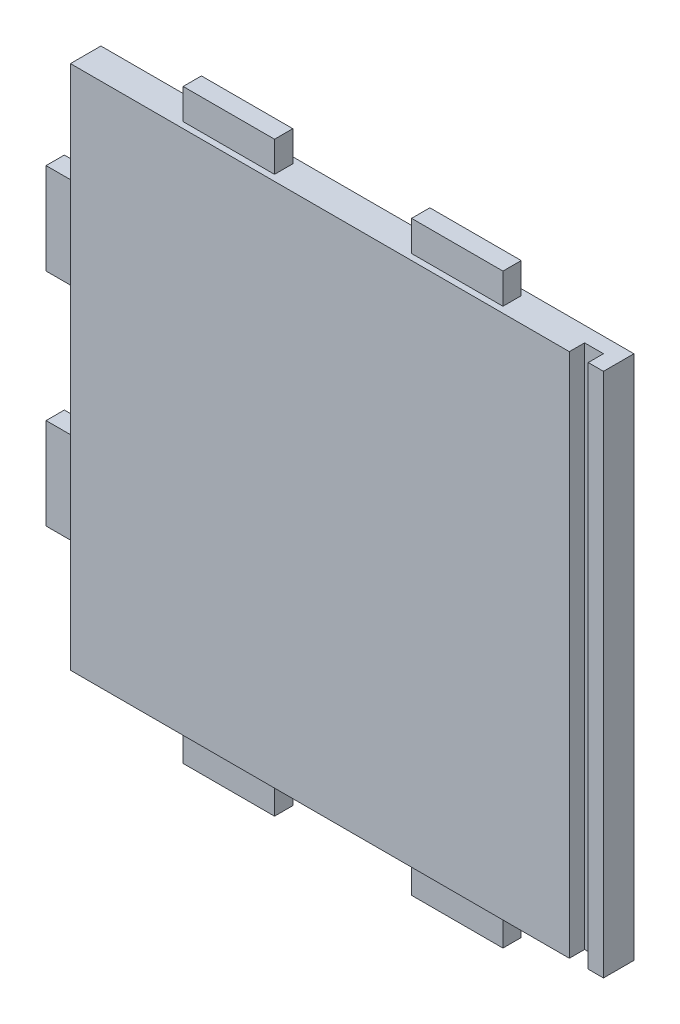
ISO-10303-21;
HEADER;
FILE_DESCRIPTION(('STEP AP214'),'2;1');
FILE_NAME('part.step','',(''),(''),'','','');
FILE_SCHEMA(('AUTOMOTIVE_DESIGN { 1 0 10303 214 1 1 1 1 }'));
ENDSEC;
DATA;
#1=APPLICATION_CONTEXT('core data for automotive mechanical design processes');
#2=APPLICATION_PROTOCOL_DEFINITION('international standard','automotive_design',2000,#1);
#3=PRODUCT_CONTEXT('',#1,'mechanical');
#4=PRODUCT('Part','Part','',(#3));
#5=PRODUCT_RELATED_PRODUCT_CATEGORY('part','',(#4));
#6=PRODUCT_DEFINITION_FORMATION('','',#4);
#7=PRODUCT_DEFINITION_CONTEXT('part definition',#1,'design');
#8=PRODUCT_DEFINITION('design','',#6,#7);
#9=PRODUCT_DEFINITION_SHAPE('','',#8);
#10=(LENGTH_UNIT() NAMED_UNIT(*) SI_UNIT(.MILLI.,.METRE.));
#11=(NAMED_UNIT(*) PLANE_ANGLE_UNIT() SI_UNIT($,.RADIAN.));
#12=(NAMED_UNIT(*) SI_UNIT($,.STERADIAN.) SOLID_ANGLE_UNIT());
#13=UNCERTAINTY_MEASURE_WITH_UNIT(LENGTH_MEASURE(1.E-05),#10,'distance_accuracy_value','');
#14=(GEOMETRIC_REPRESENTATION_CONTEXT(3) GLOBAL_UNCERTAINTY_ASSIGNED_CONTEXT((#13)) GLOBAL_UNIT_ASSIGNED_CONTEXT((#10,
#11,#12)) REPRESENTATION_CONTEXT('',''));
#15=CARTESIAN_POINT('',(0.,0.,0.));
#16=DIRECTION('',(0.,0.,1.));
#17=DIRECTION('',(1.,0.,0.));
#18=AXIS2_PLACEMENT_3D('',#15,#16,#17);
#19=CARTESIAN_POINT('',(0.,0.,10.));
#20=DIRECTION('',(0.,0.,1.));
#21=DIRECTION('',(1.,0.,0.));
#22=AXIS2_PLACEMENT_3D('',#19,#20,#21);
#23=PLANE('',#22);
#24=DIRECTION('',(0.,-1.,0.));
#25=VECTOR('',#24,1.);
#26=CARTESIAN_POINT('',(76.3,-86.25,10.));
#27=LINE('',#26,#25);
#28=CARTESIAN_POINT('',(76.3,86.25,10.));
#29=VERTEX_POINT('',#28);
#30=CARTESIAN_POINT('',(76.3,-86.25,10.));
#31=VERTEX_POINT('',#30);
#32=EDGE_CURVE('E246',#29,#31,#27,.T.);
#33=ORIENTED_EDGE('',*,*,#32,.F.);
#34=DIRECTION('',(-1.,0.,0.));
#35=VECTOR('',#34,1.);
#36=CARTESIAN_POINT('',(87.5,86.25,10.));
#37=LINE('',#36,#35);
#38=CARTESIAN_POINT('',(-87.5,86.25,10.));
#39=VERTEX_POINT('',#38);
#40=EDGE_CURVE('E483',#29,#39,#37,.T.);
#41=ORIENTED_EDGE('',*,*,#40,.T.);
#42=DIRECTION('',(0.,-1.,0.));
#43=VECTOR('',#42,1.);
#44=CARTESIAN_POINT('',(-87.5,-86.25,10.));
#45=LINE('',#44,#43);
#46=CARTESIAN_POINT('',(-87.5,-86.25,10.));
#47=VERTEX_POINT('',#46);
#48=EDGE_CURVE('E474',#39,#47,#45,.T.);
#49=ORIENTED_EDGE('',*,*,#48,.T.);
#50=DIRECTION('',(1.,0.,0.));
#51=VECTOR('',#50,1.);
#52=CARTESIAN_POINT('',(87.5,-86.25,10.));
#53=LINE('',#52,#51);
#54=EDGE_CURVE('E479',#47,#31,#53,.T.);
#55=ORIENTED_EDGE('',*,*,#54,.T.);
#56=EDGE_LOOP('',(#33,#41,#49,#55));
#57=FACE_BOUND('',#56,.T.);
#58=ADVANCED_FACE('F32',(#57),#23,.T.);
#59=CARTESIAN_POINT('',(87.5,-86.25,10.));
#60=DIRECTION('',(0.,1.,0.));
#61=DIRECTION('',(-1.,0.,0.));
#62=AXIS2_PLACEMENT_3D('',#59,#60,#61);
#63=PLANE('',#62);
#64=CARTESIAN_POINT('',(65.,-86.25,5.));
#65=DIRECTION('',(0.,-1.,0.));
#66=DIRECTION('',(1.,0.,0.));
#67=AXIS2_PLACEMENT_3D('',#64,#65,#66);
#68=CIRCLE('',#67,1.5);
#69=CARTESIAN_POINT('',(66.5,-86.25,5.));
#70=VERTEX_POINT('',#69);
#71=EDGE_CURVE('E946',#70,#70,#68,.T.);
#72=ORIENTED_EDGE('',*,*,#71,.F.);
#73=EDGE_LOOP('',(#72));
#74=FACE_BOUND('',#73,.T.);
#75=DIRECTION('',(0.,0.,-1.));
#76=VECTOR('',#75,1.);
#77=CARTESIAN_POINT('',(-52.5,-86.25,2.));
#78=LINE('',#77,#76);
#79=CARTESIAN_POINT('',(-52.5,-86.25,8.));
#80=VERTEX_POINT('',#79);
#81=CARTESIAN_POINT('',(-52.5,-86.25,2.));
#82=VERTEX_POINT('',#81);
#83=EDGE_CURVE('E308',#80,#82,#78,.T.);
#84=ORIENTED_EDGE('',*,*,#83,.F.);
#85=DIRECTION('',(-1.,0.,0.));
#86=VECTOR('',#85,1.);
#87=CARTESIAN_POINT('',(-22.5,-86.25,8.));
#88=LINE('',#87,#86);
#89=CARTESIAN_POINT('',(-22.5,-86.25,8.));
#90=VERTEX_POINT('',#89);
#91=EDGE_CURVE('E313',#90,#80,#88,.T.);
#92=ORIENTED_EDGE('',*,*,#91,.F.);
#93=DIRECTION('',(0.,0.,1.));
#94=VECTOR('',#93,1.);
#95=CARTESIAN_POINT('',(-22.5,-86.25,2.));
#96=LINE('',#95,#94);
#97=CARTESIAN_POINT('',(-22.5,-86.25,2.));
#98=VERTEX_POINT('',#97);
#99=EDGE_CURVE('E325',#98,#90,#96,.T.);
#100=ORIENTED_EDGE('',*,*,#99,.F.);
#101=DIRECTION('',(1.,0.,0.));
#102=VECTOR('',#101,1.);
#103=CARTESIAN_POINT('',(-22.5,-86.25,2.));
#104=LINE('',#103,#102);
#105=EDGE_CURVE('E322',#82,#98,#104,.T.);
#106=ORIENTED_EDGE('',*,*,#105,.F.);
#107=EDGE_LOOP('',(#84,#92,#100,#106));
#108=FACE_BOUND('',#107,.T.);
#109=DIRECTION('',(1.,0.,0.));
#110=VECTOR('',#109,1.);
#111=CARTESIAN_POINT('',(82.5,-86.25,5.));
#112=LINE('',#111,#110);
#113=CARTESIAN_POINT('',(76.3,-86.25,5.));
#114=VERTEX_POINT('',#113);
#115=CARTESIAN_POINT('',(82.5,-86.25,5.));
#116=VERTEX_POINT('',#115);
#117=EDGE_CURVE('E256',#114,#116,#112,.T.);
#118=ORIENTED_EDGE('',*,*,#117,.F.);
#119=DIRECTION('',(0.,0.,1.));
#120=VECTOR('',#119,1.);
#121=CARTESIAN_POINT('',(76.3,-86.25,5.));
#122=LINE('',#121,#120);
#123=EDGE_CURVE('E240',#114,#31,#122,.T.);
#124=ORIENTED_EDGE('',*,*,#123,.T.);
#125=ORIENTED_EDGE('',*,*,#54,.F.);
#126=DIRECTION('',(0.,0.,-1.));
#127=VECTOR('',#126,1.);
#128=CARTESIAN_POINT('',(-87.5,-86.25,10.));
#129=LINE('',#128,#127);
#130=CARTESIAN_POINT('',(-87.5,-86.25,0.));
#131=VERTEX_POINT('',#130);
#132=EDGE_CURVE('E11',#47,#131,#129,.T.);
#133=ORIENTED_EDGE('',*,*,#132,.T.);
#134=DIRECTION('',(1.,0.,0.));
#135=VECTOR('',#134,1.);
#136=CARTESIAN_POINT('',(87.5,-86.25,0.));
#137=LINE('',#136,#135);
#138=CARTESIAN_POINT('',(87.5,-86.25,0.));
#139=VERTEX_POINT('',#138);
#140=EDGE_CURVE('E490',#131,#139,#137,.T.);
#141=ORIENTED_EDGE('',*,*,#140,.T.);
#142=DIRECTION('',(0.,0.,-1.));
#143=VECTOR('',#142,1.);
#144=CARTESIAN_POINT('',(87.5,-86.25,10.));
#145=LINE('',#144,#143);
#146=CARTESIAN_POINT('',(87.5,-86.25,10.));
#147=VERTEX_POINT('',#146);
#148=EDGE_CURVE('E40',#147,#139,#145,.T.);
#149=ORIENTED_EDGE('',*,*,#148,.F.);
#150=CARTESIAN_POINT('',(82.5,-86.25,10.));
#151=VERTEX_POINT('',#150);
#152=EDGE_CURVE('E477',#151,#147,#53,.T.);
#153=ORIENTED_EDGE('',*,*,#152,.F.);
#154=DIRECTION('',(0.,0.,1.));
#155=VECTOR('',#154,1.);
#156=CARTESIAN_POINT('',(82.5,-86.25,5.));
#157=LINE('',#156,#155);
#158=EDGE_CURVE('E47',#116,#151,#157,.T.);
#159=ORIENTED_EDGE('',*,*,#158,.F.);
#160=EDGE_LOOP('',(#118,#124,#125,#133,#141,#149,#153,#159));
#161=FACE_BOUND('',#160,.T.);
#162=DIRECTION('',(0.,0.,-1.));
#163=VECTOR('',#162,1.);
#164=CARTESIAN_POINT('',(22.5,-86.25,2.));
#165=LINE('',#164,#163);
#166=CARTESIAN_POINT('',(22.5,-86.25,8.));
#167=VERTEX_POINT('',#166);
#168=CARTESIAN_POINT('',(22.5,-86.25,2.));
#169=VERTEX_POINT('',#168);
#170=EDGE_CURVE('E274',#167,#169,#165,.T.);
#171=ORIENTED_EDGE('',*,*,#170,.F.);
#172=DIRECTION('',(-1.,0.,0.));
#173=VECTOR('',#172,1.);
#174=CARTESIAN_POINT('',(22.5,-86.25,8.));
#175=LINE('',#174,#173);
#176=CARTESIAN_POINT('',(52.5,-86.25,8.));
#177=VERTEX_POINT('',#176);
#178=EDGE_CURVE('E283',#177,#167,#175,.T.);
#179=ORIENTED_EDGE('',*,*,#178,.F.);
#180=DIRECTION('',(0.,0.,1.));
#181=VECTOR('',#180,1.);
#182=CARTESIAN_POINT('',(52.5,-86.25,2.));
#183=LINE('',#182,#181);
#184=CARTESIAN_POINT('',(52.5,-86.25,2.));
#185=VERTEX_POINT('',#184);
#186=EDGE_CURVE('E293',#185,#177,#183,.T.);
#187=ORIENTED_EDGE('',*,*,#186,.F.);
#188=DIRECTION('',(1.,0.,0.));
#189=VECTOR('',#188,1.);
#190=CARTESIAN_POINT('',(22.5,-86.25,2.));
#191=LINE('',#190,#189);
#192=EDGE_CURVE('E55',#169,#185,#191,.T.);
#193=ORIENTED_EDGE('',*,*,#192,.F.);
#194=EDGE_LOOP('',(#171,#179,#187,#193));
#195=FACE_BOUND('',#194,.T.);
#196=ADVANCED_FACE('F261',(#74,#108,#161,#195),#63,.F.);
#197=CARTESIAN_POINT('',(-87.5,-86.25,10.));
#198=DIRECTION('',(1.,0.,0.));
#199=DIRECTION('',(0.,0.,-1.));
#200=AXIS2_PLACEMENT_3D('',#197,#198,#199);
#201=PLANE('',#200);
#202=CARTESIAN_POINT('',(-87.5,-71.25,5.00000000000002));
#203=DIRECTION('',(-1.,0.,0.));
#204=DIRECTION('',(0.,0.,1.));
#205=AXIS2_PLACEMENT_3D('',#202,#203,#204);
#206=CIRCLE('',#205,1.5);
#207=CARTESIAN_POINT('',(-87.5,-71.25,6.50000000000002));
#208=VERTEX_POINT('',#207);
#209=EDGE_CURVE('E562',#208,#208,#206,.T.);
#210=ORIENTED_EDGE('',*,*,#209,.F.);
#211=EDGE_LOOP('',(#210));
#212=FACE_BOUND('',#211,.T.);
#213=DIRECTION('',(0.,-1.,0.));
#214=VECTOR('',#213,1.);
#215=CARTESIAN_POINT('',(-87.5,21.25,2.00000000000001));
#216=LINE('',#215,#214);
#217=CARTESIAN_POINT('',(-87.5,51.25,2.00000000000001));
#218=VERTEX_POINT('',#217);
#219=CARTESIAN_POINT('',(-87.5,21.25,2.00000000000001));
#220=VERTEX_POINT('',#219);
#221=EDGE_CURVE('E374',#218,#220,#216,.T.);
#222=ORIENTED_EDGE('',*,*,#221,.F.);
#223=DIRECTION('',(0.,0.,-1.));
#224=VECTOR('',#223,1.);
#225=CARTESIAN_POINT('',(-87.5,51.25,8.00000000000001));
#226=LINE('',#225,#224);
#227=CARTESIAN_POINT('',(-87.5,51.25,8.00000000000001));
#228=VERTEX_POINT('',#227);
#229=EDGE_CURVE('E379',#228,#218,#226,.T.);
#230=ORIENTED_EDGE('',*,*,#229,.F.);
#231=DIRECTION('',(0.,1.,0.));
#232=VECTOR('',#231,1.);
#233=CARTESIAN_POINT('',(-87.5,21.25,8.00000000000001));
#234=LINE('',#233,#232);
#235=CARTESIAN_POINT('',(-87.5,21.25,8.00000000000001));
#236=VERTEX_POINT('',#235);
#237=EDGE_CURVE('E391',#236,#228,#234,.T.);
#238=ORIENTED_EDGE('',*,*,#237,.F.);
#239=DIRECTION('',(0.,0.,1.));
#240=VECTOR('',#239,1.);
#241=CARTESIAN_POINT('',(-87.5,21.25,8.00000000000001));
#242=LINE('',#241,#240);
#243=EDGE_CURVE('E388',#220,#236,#242,.T.);
#244=ORIENTED_EDGE('',*,*,#243,.F.);
#245=EDGE_LOOP('',(#222,#230,#238,#244));
#246=FACE_BOUND('',#245,.T.);
#247=DIRECTION('',(0.,-1.,0.));
#248=VECTOR('',#247,1.);
#249=CARTESIAN_POINT('',(-87.5,-86.25,0.));
#250=LINE('',#249,#248);
#251=CARTESIAN_POINT('',(-87.5,86.25,0.));
#252=VERTEX_POINT('',#251);
#253=EDGE_CURVE('E473',#252,#131,#250,.T.);
#254=ORIENTED_EDGE('',*,*,#253,.T.);
#255=ORIENTED_EDGE('',*,*,#132,.F.);
#256=ORIENTED_EDGE('',*,*,#48,.F.);
#257=DIRECTION('',(0.,0.,-1.));
#258=VECTOR('',#257,1.);
#259=CARTESIAN_POINT('',(-87.5,86.25,10.));
#260=LINE('',#259,#258);
#261=EDGE_CURVE('E487',#39,#252,#260,.T.);
#262=ORIENTED_EDGE('',*,*,#261,.T.);
#263=EDGE_LOOP('',(#254,#255,#256,#262));
#264=FACE_BOUND('',#263,.T.);
#265=DIRECTION('',(0.,1.,0.));
#266=VECTOR('',#265,1.);
#267=CARTESIAN_POINT('',(-87.5,-21.25,8.00000000000001));
#268=LINE('',#267,#266);
#269=CARTESIAN_POINT('',(-87.5,-51.25,8.00000000000001));
#270=VERTEX_POINT('',#269);
#271=CARTESIAN_POINT('',(-87.5,-21.25,8.00000000000001));
#272=VERTEX_POINT('',#271);
#273=EDGE_CURVE('E341',#270,#272,#268,.T.);
#274=ORIENTED_EDGE('',*,*,#273,.F.);
#275=DIRECTION('',(0.,0.,1.));
#276=VECTOR('',#275,1.);
#277=CARTESIAN_POINT('',(-87.5,-51.25,8.00000000000001));
#278=LINE('',#277,#276);
#279=CARTESIAN_POINT('',(-87.5,-51.25,2.00000000000001));
#280=VERTEX_POINT('',#279);
#281=EDGE_CURVE('E346',#280,#270,#278,.T.);
#282=ORIENTED_EDGE('',*,*,#281,.F.);
#283=DIRECTION('',(0.,-1.,0.));
#284=VECTOR('',#283,1.);
#285=CARTESIAN_POINT('',(-87.5,-21.25,2.00000000000001));
#286=LINE('',#285,#284);
#287=CARTESIAN_POINT('',(-87.5,-21.25,2.00000000000001));
#288=VERTEX_POINT('',#287);
#289=EDGE_CURVE('E358',#288,#280,#286,.T.);
#290=ORIENTED_EDGE('',*,*,#289,.F.);
#291=DIRECTION('',(0.,0.,-1.));
#292=VECTOR('',#291,1.);
#293=CARTESIAN_POINT('',(-87.5,-21.25,8.00000000000001));
#294=LINE('',#293,#292);
#295=EDGE_CURVE('E355',#272,#288,#294,.T.);
#296=ORIENTED_EDGE('',*,*,#295,.F.);
#297=EDGE_LOOP('',(#274,#282,#290,#296));
#298=FACE_BOUND('',#297,.T.);
#299=ADVANCED_FACE('F34',(#212,#246,#264,#298),#201,.F.);
#300=CARTESIAN_POINT('',(87.5,86.25,10.));
#301=DIRECTION('',(0.,-1.,0.));
#302=DIRECTION('',(1.,0.,0.));
#303=AXIS2_PLACEMENT_3D('',#300,#301,#302);
#304=PLANE('',#303);
#305=ORIENTED_EDGE('',*,*,#40,.F.);
#306=DIRECTION('',(0.,0.,1.));
#307=VECTOR('',#306,1.);
#308=CARTESIAN_POINT('',(76.3,86.25,5.));
#309=LINE('',#308,#307);
#310=CARTESIAN_POINT('',(76.3,86.25,5.));
#311=VERTEX_POINT('',#310);
#312=EDGE_CURVE('E272',#311,#29,#309,.T.);
#313=ORIENTED_EDGE('',*,*,#312,.F.);
#314=DIRECTION('',(-1.,0.,0.));
#315=VECTOR('',#314,1.);
#316=CARTESIAN_POINT('',(82.5,86.25,5.));
#317=LINE('',#316,#315);
#318=CARTESIAN_POINT('',(82.5,86.25,5.));
#319=VERTEX_POINT('',#318);
#320=EDGE_CURVE('E250',#319,#311,#317,.T.);
#321=ORIENTED_EDGE('',*,*,#320,.F.);
#322=DIRECTION('',(0.,0.,1.));
#323=VECTOR('',#322,1.);
#324=CARTESIAN_POINT('',(82.5,86.25,5.));
#325=LINE('',#324,#323);
#326=CARTESIAN_POINT('',(82.5,86.25,10.));
#327=VERTEX_POINT('',#326);
#328=EDGE_CURVE('E275',#319,#327,#325,.T.);
#329=ORIENTED_EDGE('',*,*,#328,.T.);
#330=CARTESIAN_POINT('',(87.5,86.25,10.));
#331=VERTEX_POINT('',#330);
#332=EDGE_CURVE('E484',#331,#327,#37,.T.);
#333=ORIENTED_EDGE('',*,*,#332,.F.);
#334=DIRECTION('',(0.,0.,-1.));
#335=VECTOR('',#334,1.);
#336=CARTESIAN_POINT('',(87.5,86.25,10.));
#337=LINE('',#336,#335);
#338=CARTESIAN_POINT('',(87.5,86.25,0.));
#339=VERTEX_POINT('',#338);
#340=EDGE_CURVE('E497',#331,#339,#337,.T.);
#341=ORIENTED_EDGE('',*,*,#340,.T.);
#342=DIRECTION('',(-1.,0.,0.));
#343=VECTOR('',#342,1.);
#344=CARTESIAN_POINT('',(87.5,86.25,0.));
#345=LINE('',#344,#343);
#346=EDGE_CURVE('E478',#339,#252,#345,.T.);
#347=ORIENTED_EDGE('',*,*,#346,.T.);
#348=ORIENTED_EDGE('',*,*,#261,.F.);
#349=EDGE_LOOP('',(#305,#313,#321,#329,#333,#341,#347,#348));
#350=FACE_BOUND('',#349,.T.);
#351=DIRECTION('',(0.,0.,1.));
#352=VECTOR('',#351,1.);
#353=CARTESIAN_POINT('',(-52.5,86.25,7.99999999999998));
#354=LINE('',#353,#352);
#355=CARTESIAN_POINT('',(-52.5,86.25,1.99999999999999));
#356=VERTEX_POINT('',#355);
#357=CARTESIAN_POINT('',(-52.5,86.25,7.99999999999998));
#358=VERTEX_POINT('',#357);
#359=EDGE_CURVE('E440',#356,#358,#354,.T.);
#360=ORIENTED_EDGE('',*,*,#359,.F.);
#361=DIRECTION('',(-1.,0.,0.));
#362=VECTOR('',#361,1.);
#363=CARTESIAN_POINT('',(-22.5,86.25,1.99999999999998));
#364=LINE('',#363,#362);
#365=CARTESIAN_POINT('',(-22.5,86.25,1.99999999999998));
#366=VERTEX_POINT('',#365);
#367=EDGE_CURVE('E445',#366,#356,#364,.T.);
#368=ORIENTED_EDGE('',*,*,#367,.F.);
#369=DIRECTION('',(0.,0.,-1.));
#370=VECTOR('',#369,1.);
#371=CARTESIAN_POINT('',(-22.5,86.25,7.99999999999998));
#372=LINE('',#371,#370);
#373=CARTESIAN_POINT('',(-22.5,86.25,7.99999999999998));
#374=VERTEX_POINT('',#373);
#375=EDGE_CURVE('E457',#374,#366,#372,.T.);
#376=ORIENTED_EDGE('',*,*,#375,.F.);
#377=DIRECTION('',(1.,0.,0.));
#378=VECTOR('',#377,1.);
#379=CARTESIAN_POINT('',(-22.5,86.25,7.99999999999998));
#380=LINE('',#379,#378);
#381=EDGE_CURVE('E454',#358,#374,#380,.T.);
#382=ORIENTED_EDGE('',*,*,#381,.F.);
#383=EDGE_LOOP('',(#360,#368,#376,#382));
#384=FACE_BOUND('',#383,.T.);
#385=DIRECTION('',(0.,0.,1.));
#386=VECTOR('',#385,1.);
#387=CARTESIAN_POINT('',(22.5,86.25,7.99999999999998));
#388=LINE('',#387,#386);
#389=CARTESIAN_POINT('',(22.5,86.25,1.99999999999998));
#390=VERTEX_POINT('',#389);
#391=CARTESIAN_POINT('',(22.5,86.25,7.99999999999998));
#392=VERTEX_POINT('',#391);
#393=EDGE_CURVE('E407',#390,#392,#388,.T.);
#394=ORIENTED_EDGE('',*,*,#393,.F.);
#395=DIRECTION('',(-1.,0.,0.));
#396=VECTOR('',#395,1.);
#397=CARTESIAN_POINT('',(22.5,86.25,1.99999999999998));
#398=LINE('',#397,#396);
#399=CARTESIAN_POINT('',(52.5,86.25,1.99999999999997));
#400=VERTEX_POINT('',#399);
#401=EDGE_CURVE('E412',#400,#390,#398,.T.);
#402=ORIENTED_EDGE('',*,*,#401,.F.);
#403=DIRECTION('',(0.,0.,-1.));
#404=VECTOR('',#403,1.);
#405=CARTESIAN_POINT('',(52.5,86.25,7.99999999999997));
#406=LINE('',#405,#404);
#407=CARTESIAN_POINT('',(52.5,86.25,7.99999999999997));
#408=VERTEX_POINT('',#407);
#409=EDGE_CURVE('E424',#408,#400,#406,.T.);
#410=ORIENTED_EDGE('',*,*,#409,.F.);
#411=DIRECTION('',(1.,0.,0.));
#412=VECTOR('',#411,1.);
#413=CARTESIAN_POINT('',(22.5,86.25,7.99999999999998));
#414=LINE('',#413,#412);
#415=EDGE_CURVE('E421',#392,#408,#414,.T.);
#416=ORIENTED_EDGE('',*,*,#415,.F.);
#417=EDGE_LOOP('',(#394,#402,#410,#416));
#418=FACE_BOUND('',#417,.T.);
#419=ADVANCED_FACE('F513',(#350,#384,#418),#304,.F.);
#420=CARTESIAN_POINT('',(87.5,-86.25,10.));
#421=DIRECTION('',(-1.,0.,0.));
#422=DIRECTION('',(0.,0.,1.));
#423=AXIS2_PLACEMENT_3D('',#420,#421,#422);
#424=PLANE('',#423);
#425=DIRECTION('',(0.,1.,0.));
#426=VECTOR('',#425,1.);
#427=CARTESIAN_POINT('',(87.5,-86.25,0.));
#428=LINE('',#427,#426);
#429=EDGE_CURVE('E492',#139,#339,#428,.T.);
#430=ORIENTED_EDGE('',*,*,#429,.T.);
#431=ORIENTED_EDGE('',*,*,#340,.F.);
#432=DIRECTION('',(0.,1.,0.));
#433=VECTOR('',#432,1.);
#434=CARTESIAN_POINT('',(87.5,-86.25,10.));
#435=LINE('',#434,#433);
#436=EDGE_CURVE('E481',#147,#331,#435,.T.);
#437=ORIENTED_EDGE('',*,*,#436,.F.);
#438=ORIENTED_EDGE('',*,*,#148,.T.);
#439=EDGE_LOOP('',(#430,#431,#437,#438));
#440=FACE_BOUND('',#439,.T.);
#441=ADVANCED_FACE('F504',(#440),#424,.F.);
#442=DIRECTION('',(0.,1.,0.));
#443=VECTOR('',#442,1.);
#444=CARTESIAN_POINT('',(82.5,-86.25,10.));
#445=LINE('',#444,#443);
#446=EDGE_CURVE('E259',#151,#327,#445,.T.);
#447=ORIENTED_EDGE('',*,*,#446,.F.);
#448=ORIENTED_EDGE('',*,*,#152,.T.);
#449=ORIENTED_EDGE('',*,*,#436,.T.);
#450=ORIENTED_EDGE('',*,*,#332,.T.);
#451=EDGE_LOOP('',(#447,#448,#449,#450));
#452=FACE_BOUND('',#451,.T.);
#453=ADVANCED_FACE('F522',(#452),#23,.T.);
#454=CARTESIAN_POINT('',(0.,0.,0.));
#455=DIRECTION('',(0.,0.,1.));
#456=DIRECTION('',(1.,0.,0.));
#457=AXIS2_PLACEMENT_3D('',#454,#455,#456);
#458=PLANE('',#457);
#459=ORIENTED_EDGE('',*,*,#253,.F.);
#460=ORIENTED_EDGE('',*,*,#346,.F.);
#461=ORIENTED_EDGE('',*,*,#429,.F.);
#462=ORIENTED_EDGE('',*,*,#140,.F.);
#463=EDGE_LOOP('',(#459,#460,#461,#462));
#464=FACE_BOUND('',#463,.T.);
#465=ADVANCED_FACE('F509',(#464),#458,.F.);
#466=CARTESIAN_POINT('',(-52.5,96.25,7.99999999999998));
#467=DIRECTION('',(1.,0.,0.));
#468=DIRECTION('',(0.,1.,0.));
#469=AXIS2_PLACEMENT_3D('',#466,#467,#468);
#470=PLANE('',#469);
#471=ORIENTED_EDGE('',*,*,#359,.T.);
#472=DIRECTION('',(0.,-1.,0.));
#473=VECTOR('',#472,1.);
#474=CARTESIAN_POINT('',(-52.5,96.25,7.99999999999998));
#475=LINE('',#474,#473);
#476=CARTESIAN_POINT('',(-52.5,96.25,7.99999999999998));
#477=VERTEX_POINT('',#476);
#478=EDGE_CURVE('E470',#477,#358,#475,.T.);
#479=ORIENTED_EDGE('',*,*,#478,.F.);
#480=DIRECTION('',(0.,0.,1.));
#481=VECTOR('',#480,1.);
#482=CARTESIAN_POINT('',(-52.5,96.25,7.99999999999998));
#483=LINE('',#482,#481);
#484=CARTESIAN_POINT('',(-52.5,96.25,1.99999999999999));
#485=VERTEX_POINT('',#484);
#486=EDGE_CURVE('E441',#485,#477,#483,.T.);
#487=ORIENTED_EDGE('',*,*,#486,.F.);
#488=DIRECTION('',(0.,-1.,0.));
#489=VECTOR('',#488,1.);
#490=CARTESIAN_POINT('',(-52.5,96.25,1.99999999999999));
#491=LINE('',#490,#489);
#492=EDGE_CURVE('E451',#485,#356,#491,.T.);
#493=ORIENTED_EDGE('',*,*,#492,.T.);
#494=EDGE_LOOP('',(#471,#479,#487,#493));
#495=FACE_BOUND('',#494,.T.);
#496=ADVANCED_FACE('F547',(#495),#470,.F.);
#497=CARTESIAN_POINT('',(-22.5,96.25,7.99999999999998));
#498=DIRECTION('',(0.,0.,-1.));
#499=DIRECTION('',(-1.,0.,0.));
#500=AXIS2_PLACEMENT_3D('',#497,#498,#499);
#501=PLANE('',#500);
#502=ORIENTED_EDGE('',*,*,#381,.T.);
#503=DIRECTION('',(0.,-1.,0.));
#504=VECTOR('',#503,1.);
#505=CARTESIAN_POINT('',(-22.5,96.25,7.99999999999998));
#506=LINE('',#505,#504);
#507=CARTESIAN_POINT('',(-22.5,96.25,7.99999999999998));
#508=VERTEX_POINT('',#507);
#509=EDGE_CURVE('E467',#508,#374,#506,.T.);
#510=ORIENTED_EDGE('',*,*,#509,.F.);
#511=DIRECTION('',(1.,0.,0.));
#512=VECTOR('',#511,1.);
#513=CARTESIAN_POINT('',(-22.5,96.25,7.99999999999998));
#514=LINE('',#513,#512);
#515=EDGE_CURVE('E444',#477,#508,#514,.T.);
#516=ORIENTED_EDGE('',*,*,#515,.F.);
#517=ORIENTED_EDGE('',*,*,#478,.T.);
#518=EDGE_LOOP('',(#502,#510,#516,#517));
#519=FACE_BOUND('',#518,.T.);
#520=ADVANCED_FACE('F621',(#519),#501,.F.);
#521=CARTESIAN_POINT('',(-22.5,96.25,7.99999999999998));
#522=DIRECTION('',(-1.,0.,0.));
#523=DIRECTION('',(0.,-1.,0.));
#524=AXIS2_PLACEMENT_3D('',#521,#522,#523);
#525=PLANE('',#524);
#526=ORIENTED_EDGE('',*,*,#375,.T.);
#527=DIRECTION('',(0.,-1.,0.));
#528=VECTOR('',#527,1.);
#529=CARTESIAN_POINT('',(-22.5,96.25,1.99999999999998));
#530=LINE('',#529,#528);
#531=CARTESIAN_POINT('',(-22.5,96.25,1.99999999999998));
#532=VERTEX_POINT('',#531);
#533=EDGE_CURVE('E464',#532,#366,#530,.T.);
#534=ORIENTED_EDGE('',*,*,#533,.F.);
#535=DIRECTION('',(0.,0.,-1.));
#536=VECTOR('',#535,1.);
#537=CARTESIAN_POINT('',(-22.5,96.25,7.99999999999998));
#538=LINE('',#537,#536);
#539=EDGE_CURVE('E447',#508,#532,#538,.T.);
#540=ORIENTED_EDGE('',*,*,#539,.F.);
#541=ORIENTED_EDGE('',*,*,#509,.T.);
#542=EDGE_LOOP('',(#526,#534,#540,#541));
#543=FACE_BOUND('',#542,.T.);
#544=ADVANCED_FACE('F617',(#543),#525,.F.);
#545=CARTESIAN_POINT('',(-22.5,96.25,1.99999999999998));
#546=DIRECTION('',(0.,0.,1.));
#547=DIRECTION('',(1.,0.,0.));
#548=AXIS2_PLACEMENT_3D('',#545,#546,#547);
#549=PLANE('',#548);
#550=ORIENTED_EDGE('',*,*,#367,.T.);
#551=ORIENTED_EDGE('',*,*,#492,.F.);
#552=DIRECTION('',(-1.,0.,0.));
#553=VECTOR('',#552,1.);
#554=CARTESIAN_POINT('',(-22.5,96.25,1.99999999999998));
#555=LINE('',#554,#553);
#556=EDGE_CURVE('E449',#532,#485,#555,.T.);
#557=ORIENTED_EDGE('',*,*,#556,.F.);
#558=ORIENTED_EDGE('',*,*,#533,.T.);
#559=EDGE_LOOP('',(#550,#551,#557,#558));
#560=FACE_BOUND('',#559,.T.);
#561=ADVANCED_FACE('F613',(#560),#549,.F.);
#562=CARTESIAN_POINT('',(0.,96.25,0.));
#563=DIRECTION('',(0.,1.,0.));
#564=DIRECTION('',(0.,0.,1.));
#565=AXIS2_PLACEMENT_3D('',#562,#563,#564);
#566=PLANE('',#565);
#567=ORIENTED_EDGE('',*,*,#486,.T.);
#568=ORIENTED_EDGE('',*,*,#515,.T.);
#569=ORIENTED_EDGE('',*,*,#539,.T.);
#570=ORIENTED_EDGE('',*,*,#556,.T.);
#571=EDGE_LOOP('',(#567,#568,#569,#570));
#572=FACE_BOUND('',#571,.T.);
#573=ADVANCED_FACE('F609',(#572),#566,.T.);
#574=CARTESIAN_POINT('',(22.5,96.25,7.99999999999998));
#575=DIRECTION('',(1.,0.,0.));
#576=DIRECTION('',(0.,1.,0.));
#577=AXIS2_PLACEMENT_3D('',#574,#575,#576);
#578=PLANE('',#577);
#579=ORIENTED_EDGE('',*,*,#393,.T.);
#580=DIRECTION('',(0.,-1.,0.));
#581=VECTOR('',#580,1.);
#582=CARTESIAN_POINT('',(22.5,96.25,7.99999999999998));
#583=LINE('',#582,#581);
#584=CARTESIAN_POINT('',(22.5,96.25,7.99999999999998));
#585=VERTEX_POINT('',#584);
#586=EDGE_CURVE('E437',#585,#392,#583,.T.);
#587=ORIENTED_EDGE('',*,*,#586,.F.);
#588=DIRECTION('',(0.,0.,1.));
#589=VECTOR('',#588,1.);
#590=CARTESIAN_POINT('',(22.5,96.25,7.99999999999998));
#591=LINE('',#590,#589);
#592=CARTESIAN_POINT('',(22.5,96.25,1.99999999999998));
#593=VERTEX_POINT('',#592);
#594=EDGE_CURVE('E408',#593,#585,#591,.T.);
#595=ORIENTED_EDGE('',*,*,#594,.F.);
#596=DIRECTION('',(0.,-1.,0.));
#597=VECTOR('',#596,1.);
#598=CARTESIAN_POINT('',(22.5,96.25,1.99999999999998));
#599=LINE('',#598,#597);
#600=EDGE_CURVE('E418',#593,#390,#599,.T.);
#601=ORIENTED_EDGE('',*,*,#600,.T.);
#602=EDGE_LOOP('',(#579,#587,#595,#601));
#603=FACE_BOUND('',#602,.T.);
#604=ADVANCED_FACE('F605',(#603),#578,.F.);
#605=CARTESIAN_POINT('',(22.5,96.25,7.99999999999998));
#606=DIRECTION('',(0.,0.,-1.));
#607=DIRECTION('',(-1.,0.,0.));
#608=AXIS2_PLACEMENT_3D('',#605,#606,#607);
#609=PLANE('',#608);
#610=ORIENTED_EDGE('',*,*,#415,.T.);
#611=DIRECTION('',(0.,-1.,0.));
#612=VECTOR('',#611,1.);
#613=CARTESIAN_POINT('',(52.5,96.25,7.99999999999997));
#614=LINE('',#613,#612);
#615=CARTESIAN_POINT('',(52.5,96.25,7.99999999999997));
#616=VERTEX_POINT('',#615);
#617=EDGE_CURVE('E434',#616,#408,#614,.T.);
#618=ORIENTED_EDGE('',*,*,#617,.F.);
#619=DIRECTION('',(1.,0.,0.));
#620=VECTOR('',#619,1.);
#621=CARTESIAN_POINT('',(22.5,96.25,7.99999999999998));
#622=LINE('',#621,#620);
#623=EDGE_CURVE('E411',#585,#616,#622,.T.);
#624=ORIENTED_EDGE('',*,*,#623,.F.);
#625=ORIENTED_EDGE('',*,*,#586,.T.);
#626=EDGE_LOOP('',(#610,#618,#624,#625));
#627=FACE_BOUND('',#626,.T.);
#628=ADVANCED_FACE('F601',(#627),#609,.F.);
#629=CARTESIAN_POINT('',(52.5,96.25,7.99999999999997));
#630=DIRECTION('',(-1.,0.,0.));
#631=DIRECTION('',(0.,-1.,0.));
#632=AXIS2_PLACEMENT_3D('',#629,#630,#631);
#633=PLANE('',#632);
#634=ORIENTED_EDGE('',*,*,#409,.T.);
#635=DIRECTION('',(0.,-1.,0.));
#636=VECTOR('',#635,1.);
#637=CARTESIAN_POINT('',(52.5,96.25,1.99999999999997));
#638=LINE('',#637,#636);
#639=CARTESIAN_POINT('',(52.5,96.25,1.99999999999997));
#640=VERTEX_POINT('',#639);
#641=EDGE_CURVE('E431',#640,#400,#638,.T.);
#642=ORIENTED_EDGE('',*,*,#641,.F.);
#643=DIRECTION('',(0.,0.,-1.));
#644=VECTOR('',#643,1.);
#645=CARTESIAN_POINT('',(52.5,96.25,7.99999999999997));
#646=LINE('',#645,#644);
#647=EDGE_CURVE('E414',#616,#640,#646,.T.);
#648=ORIENTED_EDGE('',*,*,#647,.F.);
#649=ORIENTED_EDGE('',*,*,#617,.T.);
#650=EDGE_LOOP('',(#634,#642,#648,#649));
#651=FACE_BOUND('',#650,.T.);
#652=ADVANCED_FACE('F597',(#651),#633,.F.);
#653=CARTESIAN_POINT('',(22.5,96.25,1.99999999999998));
#654=DIRECTION('',(0.,0.,1.));
#655=DIRECTION('',(1.,0.,0.));
#656=AXIS2_PLACEMENT_3D('',#653,#654,#655);
#657=PLANE('',#656);
#658=ORIENTED_EDGE('',*,*,#401,.T.);
#659=ORIENTED_EDGE('',*,*,#600,.F.);
#660=DIRECTION('',(-1.,0.,0.));
#661=VECTOR('',#660,1.);
#662=CARTESIAN_POINT('',(22.5,96.25,1.99999999999998));
#663=LINE('',#662,#661);
#664=EDGE_CURVE('E416',#640,#593,#663,.T.);
#665=ORIENTED_EDGE('',*,*,#664,.F.);
#666=ORIENTED_EDGE('',*,*,#641,.T.);
#667=EDGE_LOOP('',(#658,#659,#665,#666));
#668=FACE_BOUND('',#667,.T.);
#669=ADVANCED_FACE('F593',(#668),#657,.F.);
#670=CARTESIAN_POINT('',(0.,96.25,0.));
#671=DIRECTION('',(0.,-1.,0.));
#672=DIRECTION('',(0.,0.,-1.));
#673=AXIS2_PLACEMENT_3D('',#670,#671,#672);
#674=PLANE('',#673);
#675=ORIENTED_EDGE('',*,*,#594,.T.);
#676=ORIENTED_EDGE('',*,*,#623,.T.);
#677=ORIENTED_EDGE('',*,*,#647,.T.);
#678=ORIENTED_EDGE('',*,*,#664,.T.);
#679=EDGE_LOOP('',(#675,#676,#677,#678));
#680=FACE_BOUND('',#679,.T.);
#681=ADVANCED_FACE('F587',(#680),#674,.F.);
#682=CARTESIAN_POINT('',(-97.5,21.25,2.00000000000001));
#683=DIRECTION('',(0.,0.,1.));
#684=DIRECTION('',(1.,0.,0.));
#685=AXIS2_PLACEMENT_3D('',#682,#683,#684);
#686=PLANE('',#685);
#687=ORIENTED_EDGE('',*,*,#221,.T.);
#688=DIRECTION('',(1.,0.,0.));
#689=VECTOR('',#688,1.);
#690=CARTESIAN_POINT('',(-97.5,21.25,2.00000000000001));
#691=LINE('',#690,#689);
#692=CARTESIAN_POINT('',(-97.5,21.25,2.00000000000001));
#693=VERTEX_POINT('',#692);
#694=EDGE_CURVE('E404',#693,#220,#691,.T.);
#695=ORIENTED_EDGE('',*,*,#694,.F.);
#696=DIRECTION('',(0.,-1.,0.));
#697=VECTOR('',#696,1.);
#698=CARTESIAN_POINT('',(-97.5,21.25,2.00000000000001));
#699=LINE('',#698,#697);
#700=CARTESIAN_POINT('',(-97.5,51.25,2.00000000000001));
#701=VERTEX_POINT('',#700);
#702=EDGE_CURVE('E375',#701,#693,#699,.T.);
#703=ORIENTED_EDGE('',*,*,#702,.F.);
#704=DIRECTION('',(1.,0.,0.));
#705=VECTOR('',#704,1.);
#706=CARTESIAN_POINT('',(-97.5,51.25,2.00000000000001));
#707=LINE('',#706,#705);
#708=EDGE_CURVE('E385',#701,#218,#707,.T.);
#709=ORIENTED_EDGE('',*,*,#708,.T.);
#710=EDGE_LOOP('',(#687,#695,#703,#709));
#711=FACE_BOUND('',#710,.T.);
#712=ADVANCED_FACE('F571',(#711),#686,.F.);
#713=CARTESIAN_POINT('',(-97.5,21.25,8.00000000000001));
#714=DIRECTION('',(0.,1.,0.));
#715=DIRECTION('',(0.,0.,1.));
#716=AXIS2_PLACEMENT_3D('',#713,#714,#715);
#717=PLANE('',#716);
#718=ORIENTED_EDGE('',*,*,#243,.T.);
#719=DIRECTION('',(1.,0.,0.));
#720=VECTOR('',#719,1.);
#721=CARTESIAN_POINT('',(-97.5,21.25,8.00000000000001));
#722=LINE('',#721,#720);
#723=CARTESIAN_POINT('',(-97.5,21.25,8.00000000000001));
#724=VERTEX_POINT('',#723);
#725=EDGE_CURVE('E401',#724,#236,#722,.T.);
#726=ORIENTED_EDGE('',*,*,#725,.F.);
#727=DIRECTION('',(0.,0.,1.));
#728=VECTOR('',#727,1.);
#729=CARTESIAN_POINT('',(-97.5,21.25,8.00000000000001));
#730=LINE('',#729,#728);
#731=EDGE_CURVE('E378',#693,#724,#730,.T.);
#732=ORIENTED_EDGE('',*,*,#731,.F.);
#733=ORIENTED_EDGE('',*,*,#694,.T.);
#734=EDGE_LOOP('',(#718,#726,#732,#733));
#735=FACE_BOUND('',#734,.T.);
#736=ADVANCED_FACE('F579',(#735),#717,.F.);
#737=CARTESIAN_POINT('',(-97.5,21.25,8.00000000000001));
#738=DIRECTION('',(0.,0.,-1.));
#739=DIRECTION('',(-1.,0.,0.));
#740=AXIS2_PLACEMENT_3D('',#737,#738,#739);
#741=PLANE('',#740);
#742=ORIENTED_EDGE('',*,*,#237,.T.);
#743=DIRECTION('',(1.,0.,0.));
#744=VECTOR('',#743,1.);
#745=CARTESIAN_POINT('',(-97.5,51.25,8.00000000000001));
#746=LINE('',#745,#744);
#747=CARTESIAN_POINT('',(-97.5,51.25,8.00000000000001));
#748=VERTEX_POINT('',#747);
#749=EDGE_CURVE('E398',#748,#228,#746,.T.);
#750=ORIENTED_EDGE('',*,*,#749,.F.);
#751=DIRECTION('',(0.,1.,0.));
#752=VECTOR('',#751,1.);
#753=CARTESIAN_POINT('',(-97.5,21.25,8.00000000000001));
#754=LINE('',#753,#752);
#755=EDGE_CURVE('E381',#724,#748,#754,.T.);
#756=ORIENTED_EDGE('',*,*,#755,.F.);
#757=ORIENTED_EDGE('',*,*,#725,.T.);
#758=EDGE_LOOP('',(#742,#750,#756,#757));
#759=FACE_BOUND('',#758,.T.);
#760=ADVANCED_FACE('F577',(#759),#741,.F.);
#761=CARTESIAN_POINT('',(-97.5,51.25,8.00000000000001));
#762=DIRECTION('',(0.,-1.,0.));
#763=DIRECTION('',(0.,0.,-1.));
#764=AXIS2_PLACEMENT_3D('',#761,#762,#763);
#765=PLANE('',#764);
#766=ORIENTED_EDGE('',*,*,#229,.T.);
#767=ORIENTED_EDGE('',*,*,#708,.F.);
#768=DIRECTION('',(0.,0.,-1.));
#769=VECTOR('',#768,1.);
#770=CARTESIAN_POINT('',(-97.5,51.25,8.00000000000001));
#771=LINE('',#770,#769);
#772=EDGE_CURVE('E383',#748,#701,#771,.T.);
#773=ORIENTED_EDGE('',*,*,#772,.F.);
#774=ORIENTED_EDGE('',*,*,#749,.T.);
#775=EDGE_LOOP('',(#766,#767,#773,#774));
#776=FACE_BOUND('',#775,.T.);
#777=ADVANCED_FACE('F567',(#776),#765,.F.);
#778=CARTESIAN_POINT('',(-97.5,0.,0.));
#779=DIRECTION('',(-1.,0.,0.));
#780=DIRECTION('',(0.,0.,1.));
#781=AXIS2_PLACEMENT_3D('',#778,#779,#780);
#782=PLANE('',#781);
#783=ORIENTED_EDGE('',*,*,#702,.T.);
#784=ORIENTED_EDGE('',*,*,#731,.T.);
#785=ORIENTED_EDGE('',*,*,#755,.T.);
#786=ORIENTED_EDGE('',*,*,#772,.T.);
#787=EDGE_LOOP('',(#783,#784,#785,#786));
#788=FACE_BOUND('',#787,.T.);
#789=ADVANCED_FACE('F573',(#788),#782,.T.);
#790=CARTESIAN_POINT('',(-97.5,-21.25,8.00000000000001));
#791=DIRECTION('',(0.,0.,-1.));
#792=DIRECTION('',(-1.,0.,0.));
#793=AXIS2_PLACEMENT_3D('',#790,#791,#792);
#794=PLANE('',#793);
#795=ORIENTED_EDGE('',*,*,#273,.T.);
#796=DIRECTION('',(1.,0.,0.));
#797=VECTOR('',#796,1.);
#798=CARTESIAN_POINT('',(-97.5,-21.25,8.00000000000001));
#799=LINE('',#798,#797);
#800=CARTESIAN_POINT('',(-97.5,-21.25,8.00000000000001));
#801=VERTEX_POINT('',#800);
#802=EDGE_CURVE('E371',#801,#272,#799,.T.);
#803=ORIENTED_EDGE('',*,*,#802,.F.);
#804=DIRECTION('',(0.,1.,0.));
#805=VECTOR('',#804,1.);
#806=CARTESIAN_POINT('',(-97.5,-21.25,8.00000000000001));
#807=LINE('',#806,#805);
#808=CARTESIAN_POINT('',(-97.5,-51.25,8.00000000000001));
#809=VERTEX_POINT('',#808);
#810=EDGE_CURVE('E342',#809,#801,#807,.T.);
#811=ORIENTED_EDGE('',*,*,#810,.F.);
#812=DIRECTION('',(1.,0.,0.));
#813=VECTOR('',#812,1.);
#814=CARTESIAN_POINT('',(-97.5,-51.25,8.00000000000001));
#815=LINE('',#814,#813);
#816=EDGE_CURVE('E352',#809,#270,#815,.T.);
#817=ORIENTED_EDGE('',*,*,#816,.T.);
#818=EDGE_LOOP('',(#795,#803,#811,#817));
#819=FACE_BOUND('',#818,.T.);
#820=ADVANCED_FACE('F713',(#819),#794,.F.);
#821=CARTESIAN_POINT('',(-97.5,-21.25,8.00000000000001));
#822=DIRECTION('',(0.,-1.,0.));
#823=DIRECTION('',(0.,0.,-1.));
#824=AXIS2_PLACEMENT_3D('',#821,#822,#823);
#825=PLANE('',#824);
#826=ORIENTED_EDGE('',*,*,#295,.T.);
#827=DIRECTION('',(1.,0.,0.));
#828=VECTOR('',#827,1.);
#829=CARTESIAN_POINT('',(-97.5,-21.25,2.00000000000001));
#830=LINE('',#829,#828);
#831=CARTESIAN_POINT('',(-97.5,-21.25,2.00000000000001));
#832=VERTEX_POINT('',#831);
#833=EDGE_CURVE('E368',#832,#288,#830,.T.);
#834=ORIENTED_EDGE('',*,*,#833,.F.);
#835=DIRECTION('',(0.,0.,-1.));
#836=VECTOR('',#835,1.);
#837=CARTESIAN_POINT('',(-97.5,-21.25,8.00000000000001));
#838=LINE('',#837,#836);
#839=EDGE_CURVE('E345',#801,#832,#838,.T.);
#840=ORIENTED_EDGE('',*,*,#839,.F.);
#841=ORIENTED_EDGE('',*,*,#802,.T.);
#842=EDGE_LOOP('',(#826,#834,#840,#841));
#843=FACE_BOUND('',#842,.T.);
#844=ADVANCED_FACE('F722',(#843),#825,.F.);
#845=CARTESIAN_POINT('',(-97.5,-21.25,2.00000000000001));
#846=DIRECTION('',(0.,0.,1.));
#847=DIRECTION('',(1.,0.,0.));
#848=AXIS2_PLACEMENT_3D('',#845,#846,#847);
#849=PLANE('',#848);
#850=ORIENTED_EDGE('',*,*,#289,.T.);
#851=DIRECTION('',(1.,0.,0.));
#852=VECTOR('',#851,1.);
#853=CARTESIAN_POINT('',(-97.5,-51.25,2.00000000000001));
#854=LINE('',#853,#852);
#855=CARTESIAN_POINT('',(-97.5,-51.25,2.00000000000001));
#856=VERTEX_POINT('',#855);
#857=EDGE_CURVE('E365',#856,#280,#854,.T.);
#858=ORIENTED_EDGE('',*,*,#857,.F.);
#859=DIRECTION('',(0.,-1.,0.));
#860=VECTOR('',#859,1.);
#861=CARTESIAN_POINT('',(-97.5,-21.25,2.00000000000001));
#862=LINE('',#861,#860);
#863=EDGE_CURVE('E348',#832,#856,#862,.T.);
#864=ORIENTED_EDGE('',*,*,#863,.F.);
#865=ORIENTED_EDGE('',*,*,#833,.T.);
#866=EDGE_LOOP('',(#850,#858,#864,#865));
#867=FACE_BOUND('',#866,.T.);
#868=ADVANCED_FACE('F732',(#867),#849,.F.);
#869=CARTESIAN_POINT('',(-97.5,-51.25,8.00000000000001));
#870=DIRECTION('',(0.,1.,0.));
#871=DIRECTION('',(0.,0.,1.));
#872=AXIS2_PLACEMENT_3D('',#869,#870,#871);
#873=PLANE('',#872);
#874=ORIENTED_EDGE('',*,*,#281,.T.);
#875=ORIENTED_EDGE('',*,*,#816,.F.);
#876=DIRECTION('',(0.,0.,1.));
#877=VECTOR('',#876,1.);
#878=CARTESIAN_POINT('',(-97.5,-51.25,8.00000000000001));
#879=LINE('',#878,#877);
#880=EDGE_CURVE('E350',#856,#809,#879,.T.);
#881=ORIENTED_EDGE('',*,*,#880,.F.);
#882=ORIENTED_EDGE('',*,*,#857,.T.);
#883=EDGE_LOOP('',(#874,#875,#881,#882));
#884=FACE_BOUND('',#883,.T.);
#885=ADVANCED_FACE('F742',(#884),#873,.F.);
#886=CARTESIAN_POINT('',(-97.5,0.,0.));
#887=DIRECTION('',(1.,0.,0.));
#888=DIRECTION('',(0.,0.,-1.));
#889=AXIS2_PLACEMENT_3D('',#886,#887,#888);
#890=PLANE('',#889);
#891=ORIENTED_EDGE('',*,*,#810,.T.);
#892=ORIENTED_EDGE('',*,*,#839,.T.);
#893=ORIENTED_EDGE('',*,*,#863,.T.);
#894=ORIENTED_EDGE('',*,*,#880,.T.);
#895=EDGE_LOOP('',(#891,#892,#893,#894));
#896=FACE_BOUND('',#895,.T.);
#897=ADVANCED_FACE('F752',(#896),#890,.F.);
#898=CARTESIAN_POINT('',(-52.5,-96.25,2.));
#899=DIRECTION('',(1.,0.,0.));
#900=DIRECTION('',(0.,1.,0.));
#901=AXIS2_PLACEMENT_3D('',#898,#899,#900);
#902=PLANE('',#901);
#903=ORIENTED_EDGE('',*,*,#83,.T.);
#904=DIRECTION('',(0.,1.,0.));
#905=VECTOR('',#904,1.);
#906=CARTESIAN_POINT('',(-52.5,-96.25,2.));
#907=LINE('',#906,#905);
#908=CARTESIAN_POINT('',(-52.5,-96.25,2.));
#909=VERTEX_POINT('',#908);
#910=EDGE_CURVE('E338',#909,#82,#907,.T.);
#911=ORIENTED_EDGE('',*,*,#910,.F.);
#912=DIRECTION('',(0.,0.,-1.));
#913=VECTOR('',#912,1.);
#914=CARTESIAN_POINT('',(-52.5,-96.25,2.));
#915=LINE('',#914,#913);
#916=CARTESIAN_POINT('',(-52.5,-96.25,8.));
#917=VERTEX_POINT('',#916);
#918=EDGE_CURVE('E309',#917,#909,#915,.T.);
#919=ORIENTED_EDGE('',*,*,#918,.F.);
#920=DIRECTION('',(0.,1.,0.));
#921=VECTOR('',#920,1.);
#922=CARTESIAN_POINT('',(-52.5,-96.25,8.));
#923=LINE('',#922,#921);
#924=EDGE_CURVE('E319',#917,#80,#923,.T.);
#925=ORIENTED_EDGE('',*,*,#924,.T.);
#926=EDGE_LOOP('',(#903,#911,#919,#925));
#927=FACE_BOUND('',#926,.T.);
#928=ADVANCED_FACE('F762',(#927),#902,.F.);
#929=CARTESIAN_POINT('',(-22.5,-96.25,2.));
#930=DIRECTION('',(0.,0.,1.));
#931=DIRECTION('',(1.,0.,0.));
#932=AXIS2_PLACEMENT_3D('',#929,#930,#931);
#933=PLANE('',#932);
#934=ORIENTED_EDGE('',*,*,#105,.T.);
#935=DIRECTION('',(0.,1.,0.));
#936=VECTOR('',#935,1.);
#937=CARTESIAN_POINT('',(-22.5,-96.25,2.));
#938=LINE('',#937,#936);
#939=CARTESIAN_POINT('',(-22.5,-96.25,2.));
#940=VERTEX_POINT('',#939);
#941=EDGE_CURVE('E335',#940,#98,#938,.T.);
#942=ORIENTED_EDGE('',*,*,#941,.F.);
#943=DIRECTION('',(1.,0.,0.));
#944=VECTOR('',#943,1.);
#945=CARTESIAN_POINT('',(-22.5,-96.25,2.));
#946=LINE('',#945,#944);
#947=EDGE_CURVE('E312',#909,#940,#946,.T.);
#948=ORIENTED_EDGE('',*,*,#947,.F.);
#949=ORIENTED_EDGE('',*,*,#910,.T.);
#950=EDGE_LOOP('',(#934,#942,#948,#949));
#951=FACE_BOUND('',#950,.T.);
#952=ADVANCED_FACE('F773',(#951),#933,.F.);
#953=CARTESIAN_POINT('',(-22.5,-96.25,2.));
#954=DIRECTION('',(-1.,0.,0.));
#955=DIRECTION('',(0.,-1.,0.));
#956=AXIS2_PLACEMENT_3D('',#953,#954,#955);
#957=PLANE('',#956);
#958=ORIENTED_EDGE('',*,*,#99,.T.);
#959=DIRECTION('',(0.,1.,0.));
#960=VECTOR('',#959,1.);
#961=CARTESIAN_POINT('',(-22.5,-96.25,8.));
#962=LINE('',#961,#960);
#963=CARTESIAN_POINT('',(-22.5,-96.25,8.));
#964=VERTEX_POINT('',#963);
#965=EDGE_CURVE('E332',#964,#90,#962,.T.);
#966=ORIENTED_EDGE('',*,*,#965,.F.);
#967=DIRECTION('',(0.,0.,1.));
#968=VECTOR('',#967,1.);
#969=CARTESIAN_POINT('',(-22.5,-96.25,2.));
#970=LINE('',#969,#968);
#971=EDGE_CURVE('E315',#940,#964,#970,.T.);
#972=ORIENTED_EDGE('',*,*,#971,.F.);
#973=ORIENTED_EDGE('',*,*,#941,.T.);
#974=EDGE_LOOP('',(#958,#966,#972,#973));
#975=FACE_BOUND('',#974,.T.);
#976=ADVANCED_FACE('F783',(#975),#957,.F.);
#977=CARTESIAN_POINT('',(-22.5,-96.25,8.));
#978=DIRECTION('',(0.,0.,-1.));
#979=DIRECTION('',(-1.,0.,0.));
#980=AXIS2_PLACEMENT_3D('',#977,#978,#979);
#981=PLANE('',#980);
#982=ORIENTED_EDGE('',*,*,#91,.T.);
#983=ORIENTED_EDGE('',*,*,#924,.F.);
#984=DIRECTION('',(-1.,0.,0.));
#985=VECTOR('',#984,1.);
#986=CARTESIAN_POINT('',(-22.5,-96.25,8.));
#987=LINE('',#986,#985);
#988=EDGE_CURVE('E317',#964,#917,#987,.T.);
#989=ORIENTED_EDGE('',*,*,#988,.F.);
#990=ORIENTED_EDGE('',*,*,#965,.T.);
#991=EDGE_LOOP('',(#982,#983,#989,#990));
#992=FACE_BOUND('',#991,.T.);
#993=ADVANCED_FACE('F793',(#992),#981,.F.);
#994=CARTESIAN_POINT('',(0.,-96.25,0.));
#995=DIRECTION('',(0.,-1.,0.));
#996=DIRECTION('',(1.,0.,0.));
#997=AXIS2_PLACEMENT_3D('',#994,#995,#996);
#998=PLANE('',#997);
#999=ORIENTED_EDGE('',*,*,#918,.T.);
#1000=ORIENTED_EDGE('',*,*,#947,.T.);
#1001=ORIENTED_EDGE('',*,*,#971,.T.);
#1002=ORIENTED_EDGE('',*,*,#988,.T.);
#1003=EDGE_LOOP('',(#999,#1000,#1001,#1002));
#1004=FACE_BOUND('',#1003,.T.);
#1005=ADVANCED_FACE('F803',(#1004),#998,.T.);
#1006=CARTESIAN_POINT('',(22.5,-96.25,2.));
#1007=DIRECTION('',(1.,0.,0.));
#1008=DIRECTION('',(0.,1.,0.));
#1009=AXIS2_PLACEMENT_3D('',#1006,#1007,#1008);
#1010=PLANE('',#1009);
#1011=ORIENTED_EDGE('',*,*,#170,.T.);
#1012=DIRECTION('',(0.,1.,0.));
#1013=VECTOR('',#1012,1.);
#1014=CARTESIAN_POINT('',(22.5,-96.25,2.));
#1015=LINE('',#1014,#1013);
#1016=CARTESIAN_POINT('',(22.5,-96.25,2.));
#1017=VERTEX_POINT('',#1016);
#1018=EDGE_CURVE('E306',#1017,#169,#1015,.T.);
#1019=ORIENTED_EDGE('',*,*,#1018,.F.);
#1020=DIRECTION('',(0.,0.,-1.));
#1021=VECTOR('',#1020,1.);
#1022=CARTESIAN_POINT('',(22.5,-96.25,2.));
#1023=LINE('',#1022,#1021);
#1024=CARTESIAN_POINT('',(22.5,-96.25,8.));
#1025=VERTEX_POINT('',#1024);
#1026=EDGE_CURVE('E279',#1025,#1017,#1023,.T.);
#1027=ORIENTED_EDGE('',*,*,#1026,.F.);
#1028=DIRECTION('',(0.,1.,0.));
#1029=VECTOR('',#1028,1.);
#1030=CARTESIAN_POINT('',(22.5,-96.25,8.));
#1031=LINE('',#1030,#1029);
#1032=EDGE_CURVE('E289',#1025,#167,#1031,.T.);
#1033=ORIENTED_EDGE('',*,*,#1032,.T.);
#1034=EDGE_LOOP('',(#1011,#1019,#1027,#1033));
#1035=FACE_BOUND('',#1034,.T.);
#1036=ADVANCED_FACE('F813',(#1035),#1010,.F.);
#1037=CARTESIAN_POINT('',(22.5,-96.25,2.));
#1038=DIRECTION('',(0.,0.,1.));
#1039=DIRECTION('',(1.,0.,0.));
#1040=AXIS2_PLACEMENT_3D('',#1037,#1038,#1039);
#1041=PLANE('',#1040);
#1042=ORIENTED_EDGE('',*,*,#192,.T.);
#1043=DIRECTION('',(0.,1.,0.));
#1044=VECTOR('',#1043,1.);
#1045=CARTESIAN_POINT('',(52.5,-96.25,2.));
#1046=LINE('',#1045,#1044);
#1047=CARTESIAN_POINT('',(52.5,-96.25,2.));
#1048=VERTEX_POINT('',#1047);
#1049=EDGE_CURVE('E303',#1048,#185,#1046,.T.);
#1050=ORIENTED_EDGE('',*,*,#1049,.F.);
#1051=DIRECTION('',(1.,0.,0.));
#1052=VECTOR('',#1051,1.);
#1053=CARTESIAN_POINT('',(22.5,-96.25,2.));
#1054=LINE('',#1053,#1052);
#1055=EDGE_CURVE('E282',#1017,#1048,#1054,.T.);
#1056=ORIENTED_EDGE('',*,*,#1055,.F.);
#1057=ORIENTED_EDGE('',*,*,#1018,.T.);
#1058=EDGE_LOOP('',(#1042,#1050,#1056,#1057));
#1059=FACE_BOUND('',#1058,.T.);
#1060=ADVANCED_FACE('F823',(#1059),#1041,.F.);
#1061=CARTESIAN_POINT('',(52.5,-96.25,2.));
#1062=DIRECTION('',(-1.,0.,0.));
#1063=DIRECTION('',(0.,-1.,0.));
#1064=AXIS2_PLACEMENT_3D('',#1061,#1062,#1063);
#1065=PLANE('',#1064);
#1066=ORIENTED_EDGE('',*,*,#186,.T.);
#1067=DIRECTION('',(0.,1.,0.));
#1068=VECTOR('',#1067,1.);
#1069=CARTESIAN_POINT('',(52.5,-96.25,8.));
#1070=LINE('',#1069,#1068);
#1071=CARTESIAN_POINT('',(52.5,-96.25,8.));
#1072=VERTEX_POINT('',#1071);
#1073=EDGE_CURVE('E300',#1072,#177,#1070,.T.);
#1074=ORIENTED_EDGE('',*,*,#1073,.F.);
#1075=DIRECTION('',(0.,0.,1.));
#1076=VECTOR('',#1075,1.);
#1077=CARTESIAN_POINT('',(52.5,-96.25,2.));
#1078=LINE('',#1077,#1076);
#1079=EDGE_CURVE('E285',#1048,#1072,#1078,.T.);
#1080=ORIENTED_EDGE('',*,*,#1079,.F.);
#1081=ORIENTED_EDGE('',*,*,#1049,.T.);
#1082=EDGE_LOOP('',(#1066,#1074,#1080,#1081));
#1083=FACE_BOUND('',#1082,.T.);
#1084=ADVANCED_FACE('F833',(#1083),#1065,.F.);
#1085=CARTESIAN_POINT('',(22.5,-96.25,8.));
#1086=DIRECTION('',(0.,0.,-1.));
#1087=DIRECTION('',(-1.,0.,0.));
#1088=AXIS2_PLACEMENT_3D('',#1085,#1086,#1087);
#1089=PLANE('',#1088);
#1090=ORIENTED_EDGE('',*,*,#178,.T.);
#1091=ORIENTED_EDGE('',*,*,#1032,.F.);
#1092=DIRECTION('',(-1.,0.,0.));
#1093=VECTOR('',#1092,1.);
#1094=CARTESIAN_POINT('',(22.5,-96.25,8.));
#1095=LINE('',#1094,#1093);
#1096=EDGE_CURVE('E287',#1072,#1025,#1095,.T.);
#1097=ORIENTED_EDGE('',*,*,#1096,.F.);
#1098=ORIENTED_EDGE('',*,*,#1073,.T.);
#1099=EDGE_LOOP('',(#1090,#1091,#1097,#1098));
#1100=FACE_BOUND('',#1099,.T.);
#1101=ADVANCED_FACE('F843',(#1100),#1089,.F.);
#1102=CARTESIAN_POINT('',(0.,-96.25,0.));
#1103=DIRECTION('',(0.,1.,0.));
#1104=DIRECTION('',(-1.,0.,0.));
#1105=AXIS2_PLACEMENT_3D('',#1102,#1103,#1104);
#1106=PLANE('',#1105);
#1107=ORIENTED_EDGE('',*,*,#1026,.T.);
#1108=ORIENTED_EDGE('',*,*,#1055,.T.);
#1109=ORIENTED_EDGE('',*,*,#1079,.T.);
#1110=ORIENTED_EDGE('',*,*,#1096,.T.);
#1111=EDGE_LOOP('',(#1107,#1108,#1109,#1110));
#1112=FACE_BOUND('',#1111,.T.);
#1113=ADVANCED_FACE('F532',(#1112),#1106,.F.);
#1114=CARTESIAN_POINT('',(76.3,-86.25,5.));
#1115=DIRECTION('',(-1.,0.,0.));
#1116=DIRECTION('',(0.,0.,1.));
#1117=AXIS2_PLACEMENT_3D('',#1114,#1115,#1116);
#1118=PLANE('',#1117);
#1119=ORIENTED_EDGE('',*,*,#32,.T.);
#1120=ORIENTED_EDGE('',*,*,#123,.F.);
#1121=DIRECTION('',(0.,-1.,0.));
#1122=VECTOR('',#1121,1.);
#1123=CARTESIAN_POINT('',(76.3,-86.25,5.));
#1124=LINE('',#1123,#1122);
#1125=EDGE_CURVE('E243',#311,#114,#1124,.T.);
#1126=ORIENTED_EDGE('',*,*,#1125,.F.);
#1127=ORIENTED_EDGE('',*,*,#312,.T.);
#1128=EDGE_LOOP('',(#1119,#1120,#1126,#1127));
#1129=FACE_BOUND('',#1128,.T.);
#1130=ADVANCED_FACE('F242',(#1129),#1118,.F.);
#1131=CARTESIAN_POINT('',(82.5,-86.25,5.));
#1132=DIRECTION('',(1.,0.,0.));
#1133=DIRECTION('',(0.,0.,-1.));
#1134=AXIS2_PLACEMENT_3D('',#1131,#1132,#1133);
#1135=PLANE('',#1134);
#1136=ORIENTED_EDGE('',*,*,#446,.T.);
#1137=ORIENTED_EDGE('',*,*,#328,.F.);
#1138=DIRECTION('',(0.,1.,0.));
#1139=VECTOR('',#1138,1.);
#1140=CARTESIAN_POINT('',(82.5,-86.25,5.));
#1141=LINE('',#1140,#1139);
#1142=EDGE_CURVE('E263',#116,#319,#1141,.T.);
#1143=ORIENTED_EDGE('',*,*,#1142,.F.);
#1144=ORIENTED_EDGE('',*,*,#158,.T.);
#1145=EDGE_LOOP('',(#1136,#1137,#1143,#1144));
#1146=FACE_BOUND('',#1145,.T.);
#1147=ADVANCED_FACE('F523',(#1146),#1135,.F.);
#1148=CARTESIAN_POINT('',(0.,0.,5.));
#1149=DIRECTION('',(0.,0.,1.));
#1150=DIRECTION('',(1.,0.,0.));
#1151=AXIS2_PLACEMENT_3D('',#1148,#1149,#1150);
#1152=PLANE('',#1151);
#1153=ORIENTED_EDGE('',*,*,#1125,.T.);
#1154=ORIENTED_EDGE('',*,*,#117,.T.);
#1155=ORIENTED_EDGE('',*,*,#1142,.T.);
#1156=ORIENTED_EDGE('',*,*,#320,.T.);
#1157=EDGE_LOOP('',(#1153,#1154,#1155,#1156));
#1158=FACE_BOUND('',#1157,.T.);
#1159=ADVANCED_FACE('F254',(#1158),#1152,.T.);
#1160=CARTESIAN_POINT('',(-79.5,-71.25,5.00000000000002));
#1161=DIRECTION('',(-1.,0.,0.));
#1162=DIRECTION('',(0.,0.,1.));
#1163=AXIS2_PLACEMENT_3D('',#1160,#1161,#1162);
#1164=CYLINDRICAL_SURFACE('',#1163,1.5);
#1165=CARTESIAN_POINT('',(-79.5,-71.25,5.00000000000002));
#1166=DIRECTION('',(-1.,0.,0.));
#1167=DIRECTION('',(0.,0.,1.));
#1168=AXIS2_PLACEMENT_3D('',#1165,#1166,#1167);
#1169=CIRCLE('',#1168,1.5);
#1170=CARTESIAN_POINT('',(-79.5,-71.25,6.50000000000002));
#1171=VERTEX_POINT('',#1170);
#1172=EDGE_CURVE('E270',#1171,#1171,#1169,.T.);
#1173=ORIENTED_EDGE('',*,*,#1172,.F.);
#1174=EDGE_LOOP('',(#1173));
#1175=FACE_BOUND('',#1174,.T.);
#1176=ORIENTED_EDGE('',*,*,#209,.T.);
#1177=EDGE_LOOP('',(#1176));
#1178=FACE_BOUND('',#1177,.T.);
#1179=ADVANCED_FACE('F530',(#1175,#1178),#1164,.F.);
#1180=CARTESIAN_POINT('',(-79.5,-71.25,5.00000000000002));
#1181=DIRECTION('',(-1.,0.,0.));
#1182=DIRECTION('',(0.,0.,1.));
#1183=AXIS2_PLACEMENT_3D('',#1180,#1181,#1182);
#1184=PLANE('',#1183);
#1185=ORIENTED_EDGE('',*,*,#1172,.T.);
#1186=EDGE_LOOP('',(#1185));
#1187=FACE_BOUND('',#1186,.T.);
#1188=ADVANCED_FACE('F904',(#1187),#1184,.T.);
#1189=CARTESIAN_POINT('',(65.,-78.25,5.));
#1190=DIRECTION('',(0.,-1.,0.));
#1191=DIRECTION('',(1.,0.,0.));
#1192=AXIS2_PLACEMENT_3D('',#1189,#1190,#1191);
#1193=CYLINDRICAL_SURFACE('',#1192,1.5);
#1194=CARTESIAN_POINT('',(65.,-78.25,5.));
#1195=DIRECTION('',(0.,-1.,0.));
#1196=DIRECTION('',(1.,0.,0.));
#1197=AXIS2_PLACEMENT_3D('',#1194,#1195,#1196);
#1198=CIRCLE('',#1197,1.5);
#1199=CARTESIAN_POINT('',(66.5,-78.25,5.));
#1200=VERTEX_POINT('',#1199);
#1201=EDGE_CURVE('E945',#1200,#1200,#1198,.T.);
#1202=ORIENTED_EDGE('',*,*,#1201,.F.);
#1203=EDGE_LOOP('',(#1202));
#1204=FACE_BOUND('',#1203,.T.);
#1205=ORIENTED_EDGE('',*,*,#71,.T.);
#1206=EDGE_LOOP('',(#1205));
#1207=FACE_BOUND('',#1206,.T.);
#1208=ADVANCED_FACE('F914',(#1204,#1207),#1193,.F.);
#1209=CARTESIAN_POINT('',(65.,-78.25,5.));
#1210=DIRECTION('',(0.,-1.,0.));
#1211=DIRECTION('',(1.,0.,0.));
#1212=AXIS2_PLACEMENT_3D('',#1209,#1210,#1211);
#1213=PLANE('',#1212);
#1214=ORIENTED_EDGE('',*,*,#1201,.T.);
#1215=EDGE_LOOP('',(#1214));
#1216=FACE_BOUND('',#1215,.T.);
#1217=ADVANCED_FACE('F929',(#1216),#1213,.T.);
#1218=CLOSED_SHELL('',(#58,#196,#299,#419,#441,#453,#465,#496,#520,#544,#561,#573,#604,#628,
#652,#669,#681,#712,#736,#760,#777,#789,#820,#844,#868,#885,#897,#928,#952,#976,#993,#1005,
#1036,#1060,#1084,#1101,#1113,#1130,#1147,#1159,#1179,#1188,#1208,#1217));
#1219=MANIFOLD_SOLID_BREP('B2',#1218);
#1220=ADVANCED_BREP_SHAPE_REPRESENTATION('',(#18,#1219),#14);
#1221=SHAPE_DEFINITION_REPRESENTATION(#9,#1220);
ENDSEC;
END-ISO-10303-21;
